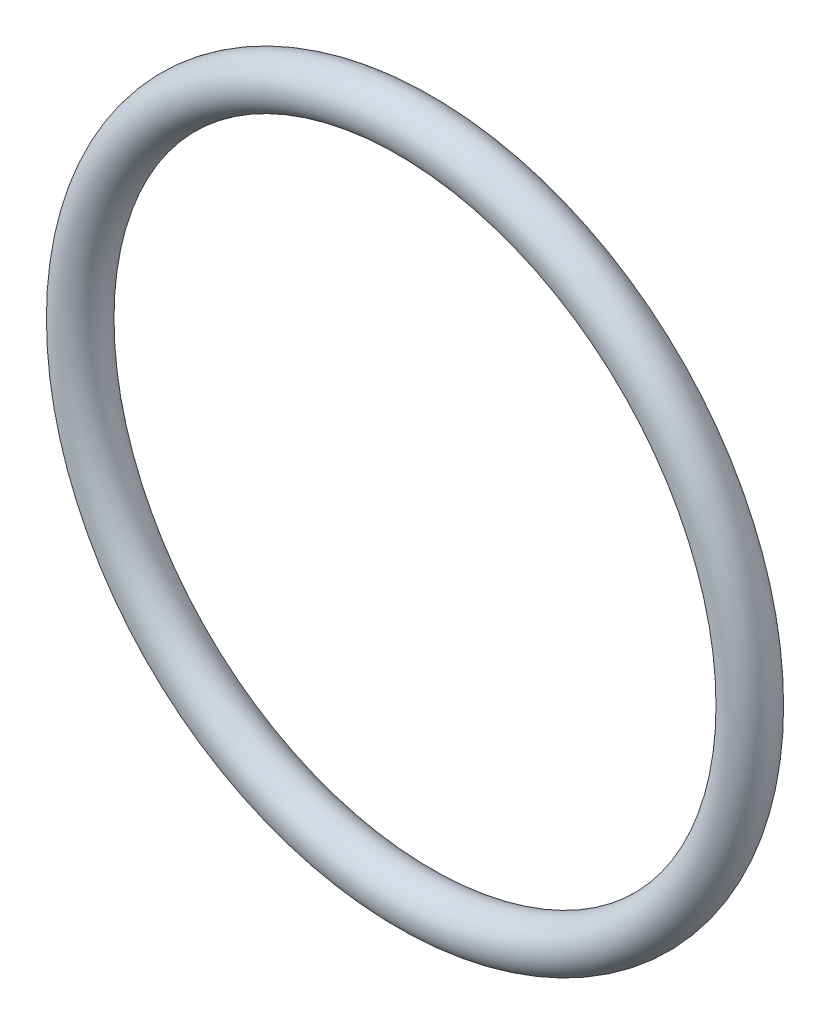
ISO-10303-21;
HEADER;
FILE_DESCRIPTION(('STEP AP214'),'2;1');
FILE_NAME('part.step','',(''),(''),'','','');
FILE_SCHEMA(('AUTOMOTIVE_DESIGN { 1 0 10303 214 1 1 1 1 }'));
ENDSEC;
DATA;
#1=APPLICATION_CONTEXT('core data for automotive mechanical design processes');
#2=APPLICATION_PROTOCOL_DEFINITION('international standard','automotive_design',2000,#1);
#3=PRODUCT_CONTEXT('',#1,'mechanical');
#4=PRODUCT('Part','Part','',(#3));
#5=PRODUCT_RELATED_PRODUCT_CATEGORY('part','',(#4));
#6=PRODUCT_DEFINITION_FORMATION('','',#4);
#7=PRODUCT_DEFINITION_CONTEXT('part definition',#1,'design');
#8=PRODUCT_DEFINITION('design','',#6,#7);
#9=PRODUCT_DEFINITION_SHAPE('','',#8);
#10=(LENGTH_UNIT() NAMED_UNIT(*) SI_UNIT(.MILLI.,.METRE.));
#11=(NAMED_UNIT(*) PLANE_ANGLE_UNIT() SI_UNIT($,.RADIAN.));
#12=(NAMED_UNIT(*) SI_UNIT($,.STERADIAN.) SOLID_ANGLE_UNIT());
#13=UNCERTAINTY_MEASURE_WITH_UNIT(LENGTH_MEASURE(1.E-05),#10,'distance_accuracy_value','');
#14=(GEOMETRIC_REPRESENTATION_CONTEXT(3) GLOBAL_UNCERTAINTY_ASSIGNED_CONTEXT((#13)) GLOBAL_UNIT_ASSIGNED_CONTEXT((#10,
#11,#12)) REPRESENTATION_CONTEXT('',''));
#15=CARTESIAN_POINT('',(0.,0.,0.));
#16=DIRECTION('',(0.,0.,1.));
#17=DIRECTION('',(1.,0.,0.));
#18=AXIS2_PLACEMENT_3D('',#15,#16,#17);
#19=CARTESIAN_POINT('',(0.,0.,0.));
#20=DIRECTION('',(0.,0.,1.));
#21=DIRECTION('',(1.,0.,0.));
#22=AXIS2_PLACEMENT_3D('',#19,#20,#21);
#23=TOROIDAL_SURFACE('',#22,7.,0.500000000000001);
#24=CARTESIAN_POINT('',(7.5,0.,0.));
#25=VERTEX_POINT('',#24);
#26=VERTEX_LOOP('',#25);
#27=FACE_BOUND('',#26,.T.);
#28=ADVANCED_FACE('F28',(#27),#23,.T.);
#29=CLOSED_SHELL('',(#28));
#30=MANIFOLD_SOLID_BREP('B2',#29);
#31=ADVANCED_BREP_SHAPE_REPRESENTATION('',(#18,#30),#14);
#32=SHAPE_DEFINITION_REPRESENTATION(#9,#31);
ENDSEC;
END-ISO-10303-21;
